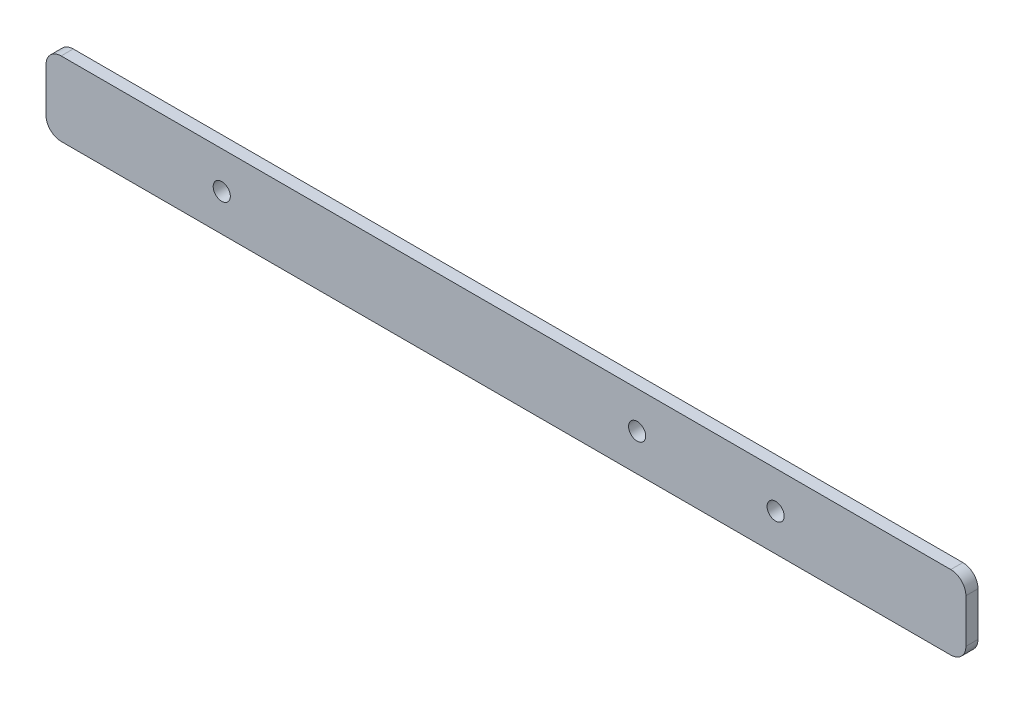
ISO-10303-21;
HEADER;
FILE_DESCRIPTION(('STEP AP214'),'2;1');
FILE_NAME('part.step','',(''),(''),'','','');
FILE_SCHEMA(('AUTOMOTIVE_DESIGN { 1 0 10303 214 1 1 1 1 }'));
ENDSEC;
DATA;
#1=APPLICATION_CONTEXT('core data for automotive mechanical design processes');
#2=APPLICATION_PROTOCOL_DEFINITION('international standard','automotive_design',2000,#1);
#3=PRODUCT_CONTEXT('',#1,'mechanical');
#4=PRODUCT('Part','Part','',(#3));
#5=PRODUCT_RELATED_PRODUCT_CATEGORY('part','',(#4));
#6=PRODUCT_DEFINITION_FORMATION('','',#4);
#7=PRODUCT_DEFINITION_CONTEXT('part definition',#1,'design');
#8=PRODUCT_DEFINITION('design','',#6,#7);
#9=PRODUCT_DEFINITION_SHAPE('','',#8);
#10=(LENGTH_UNIT() NAMED_UNIT(*) SI_UNIT(.MILLI.,.METRE.));
#11=(NAMED_UNIT(*) PLANE_ANGLE_UNIT() SI_UNIT($,.RADIAN.));
#12=(NAMED_UNIT(*) SI_UNIT($,.STERADIAN.) SOLID_ANGLE_UNIT());
#13=UNCERTAINTY_MEASURE_WITH_UNIT(LENGTH_MEASURE(1.E-05),#10,'distance_accuracy_value','');
#14=(GEOMETRIC_REPRESENTATION_CONTEXT(3) GLOBAL_UNCERTAINTY_ASSIGNED_CONTEXT((#13)) GLOBAL_UNIT_ASSIGNED_CONTEXT((#10,
#11,#12)) REPRESENTATION_CONTEXT('',''));
#15=CARTESIAN_POINT('',(0.,0.,0.));
#16=DIRECTION('',(0.,0.,1.));
#17=DIRECTION('',(1.,0.,0.));
#18=AXIS2_PLACEMENT_3D('',#15,#16,#17);
#19=CARTESIAN_POINT('',(0.,0.,3.175));
#20=DIRECTION('',(1.,0.,0.));
#21=DIRECTION('',(0.,0.,-1.));
#22=AXIS2_PLACEMENT_3D('',#19,#20,#21);
#23=PLANE('',#22);
#24=DIRECTION('',(0.,-1.,0.));
#25=VECTOR('',#24,1.);
#26=CARTESIAN_POINT('',(0.,0.,3.175));
#27=LINE('',#26,#25);
#28=CARTESIAN_POINT('',(0.,15.46225,3.175));
#29=VERTEX_POINT('',#28);
#30=CARTESIAN_POINT('',(0.,3.96875,3.175));
#31=VERTEX_POINT('',#30);
#32=EDGE_CURVE('E118',#29,#31,#27,.T.);
#33=ORIENTED_EDGE('',*,*,#32,.F.);
#34=DIRECTION('',(0.,0.,-1.));
#35=VECTOR('',#34,1.);
#36=CARTESIAN_POINT('',(0.,15.46225,3.175));
#37=LINE('',#36,#35);
#38=CARTESIAN_POINT('',(0.,15.46225,0.));
#39=VERTEX_POINT('',#38);
#40=EDGE_CURVE('E103',#29,#39,#37,.T.);
#41=ORIENTED_EDGE('',*,*,#40,.T.);
#42=DIRECTION('',(0.,-1.,0.));
#43=VECTOR('',#42,1.);
#44=CARTESIAN_POINT('',(0.,0.,0.));
#45=LINE('',#44,#43);
#46=CARTESIAN_POINT('',(0.,3.96875,0.));
#47=VERTEX_POINT('',#46);
#48=EDGE_CURVE('E115',#39,#47,#45,.T.);
#49=ORIENTED_EDGE('',*,*,#48,.T.);
#50=DIRECTION('',(0.,0.,-1.));
#51=VECTOR('',#50,1.);
#52=CARTESIAN_POINT('',(0.,3.96875,3.175));
#53=LINE('',#52,#51);
#54=EDGE_CURVE('E120',#47,#31,#53,.F.);
#55=ORIENTED_EDGE('',*,*,#54,.T.);
#56=EDGE_LOOP('',(#33,#41,#49,#55));
#57=FACE_BOUND('',#56,.T.);
#58=ADVANCED_FACE('F33',(#57),#23,.F.);
#59=CARTESIAN_POINT('',(0.,0.,3.175));
#60=DIRECTION('',(0.,1.,0.));
#61=DIRECTION('',(0.,0.,1.));
#62=AXIS2_PLACEMENT_3D('',#59,#60,#61);
#63=PLANE('',#62);
#64=DIRECTION('',(1.,0.,0.));
#65=VECTOR('',#64,1.);
#66=CARTESIAN_POINT('',(0.,0.,3.175));
#67=LINE('',#66,#65);
#68=CARTESIAN_POINT('',(3.96875,0.,3.175));
#69=VERTEX_POINT('',#68);
#70=CARTESIAN_POINT('',(237.33125,0.,3.175));
#71=VERTEX_POINT('',#70);
#72=EDGE_CURVE('E164',#69,#71,#67,.T.);
#73=ORIENTED_EDGE('',*,*,#72,.F.);
#74=DIRECTION('',(0.,0.,-1.));
#75=VECTOR('',#74,1.);
#76=CARTESIAN_POINT('',(3.96875,0.,3.175));
#77=LINE('',#76,#75);
#78=CARTESIAN_POINT('',(3.96875,0.,0.));
#79=VERTEX_POINT('',#78);
#80=EDGE_CURVE('E157',#69,#79,#77,.T.);
#81=ORIENTED_EDGE('',*,*,#80,.T.);
#82=DIRECTION('',(1.,0.,0.));
#83=VECTOR('',#82,1.);
#84=CARTESIAN_POINT('',(0.,0.,0.));
#85=LINE('',#84,#83);
#86=CARTESIAN_POINT('',(237.33125,0.,0.));
#87=VERTEX_POINT('',#86);
#88=EDGE_CURVE('E124',#79,#87,#85,.T.);
#89=ORIENTED_EDGE('',*,*,#88,.T.);
#90=DIRECTION('',(0.,0.,-1.));
#91=VECTOR('',#90,1.);
#92=CARTESIAN_POINT('',(237.33125,0.,3.175));
#93=LINE('',#92,#91);
#94=EDGE_CURVE('E155',#87,#71,#93,.F.);
#95=ORIENTED_EDGE('',*,*,#94,.T.);
#96=EDGE_LOOP('',(#73,#81,#89,#95));
#97=FACE_BOUND('',#96,.T.);
#98=ADVANCED_FACE('F162',(#97),#63,.F.);
#99=CARTESIAN_POINT('',(241.3,0.,3.175));
#100=DIRECTION('',(-1.,0.,0.));
#101=DIRECTION('',(0.,0.,1.));
#102=AXIS2_PLACEMENT_3D('',#99,#100,#101);
#103=PLANE('',#102);
#104=DIRECTION('',(0.,1.,0.));
#105=VECTOR('',#104,1.);
#106=CARTESIAN_POINT('',(241.3,0.,3.175));
#107=LINE('',#106,#105);
#108=CARTESIAN_POINT('',(241.3,3.96875,3.175));
#109=VERTEX_POINT('',#108);
#110=CARTESIAN_POINT('',(241.3,15.46225,3.175));
#111=VERTEX_POINT('',#110);
#112=EDGE_CURVE('E172',#109,#111,#107,.T.);
#113=ORIENTED_EDGE('',*,*,#112,.F.);
#114=DIRECTION('',(0.,0.,-1.));
#115=VECTOR('',#114,1.);
#116=CARTESIAN_POINT('',(241.3,3.96875,3.175));
#117=LINE('',#116,#115);
#118=CARTESIAN_POINT('',(241.3,3.96875,0.));
#119=VERTEX_POINT('',#118);
#120=EDGE_CURVE('E11',#109,#119,#117,.T.);
#121=ORIENTED_EDGE('',*,*,#120,.T.);
#122=DIRECTION('',(0.,1.,0.));
#123=VECTOR('',#122,1.);
#124=CARTESIAN_POINT('',(241.3,0.,0.));
#125=LINE('',#124,#123);
#126=CARTESIAN_POINT('',(241.3,15.46225,0.));
#127=VERTEX_POINT('',#126);
#128=EDGE_CURVE('E128',#119,#127,#125,.T.);
#129=ORIENTED_EDGE('',*,*,#128,.T.);
#130=DIRECTION('',(0.,0.,-1.));
#131=VECTOR('',#130,1.);
#132=CARTESIAN_POINT('',(241.3,15.46225,3.175));
#133=LINE('',#132,#131);
#134=EDGE_CURVE('E41',#127,#111,#133,.F.);
#135=ORIENTED_EDGE('',*,*,#134,.T.);
#136=EDGE_LOOP('',(#113,#121,#129,#135));
#137=FACE_BOUND('',#136,.T.);
#138=ADVANCED_FACE('F171',(#137),#103,.F.);
#139=CARTESIAN_POINT('',(0.,19.431,3.175));
#140=DIRECTION('',(0.,-1.,0.));
#141=DIRECTION('',(0.,0.,-1.));
#142=AXIS2_PLACEMENT_3D('',#139,#140,#141);
#143=PLANE('',#142);
#144=DIRECTION('',(-1.,0.,0.));
#145=VECTOR('',#144,1.);
#146=CARTESIAN_POINT('',(0.,19.431,0.));
#147=LINE('',#146,#145);
#148=CARTESIAN_POINT('',(237.33125,19.431,0.));
#149=VERTEX_POINT('',#148);
#150=CARTESIAN_POINT('',(3.96875,19.431,0.));
#151=VERTEX_POINT('',#150);
#152=EDGE_CURVE('E138',#149,#151,#147,.T.);
#153=ORIENTED_EDGE('',*,*,#152,.T.);
#154=DIRECTION('',(0.,0.,-1.));
#155=VECTOR('',#154,1.);
#156=CARTESIAN_POINT('',(3.96875,19.431,3.175));
#157=LINE('',#156,#155);
#158=CARTESIAN_POINT('',(3.96875,19.431,3.175));
#159=VERTEX_POINT('',#158);
#160=EDGE_CURVE('E104',#151,#159,#157,.F.);
#161=ORIENTED_EDGE('',*,*,#160,.T.);
#162=DIRECTION('',(-1.,0.,0.));
#163=VECTOR('',#162,1.);
#164=CARTESIAN_POINT('',(0.,19.431,3.175));
#165=LINE('',#164,#163);
#166=CARTESIAN_POINT('',(237.33125,19.431,3.175));
#167=VERTEX_POINT('',#166);
#168=EDGE_CURVE('E134',#167,#159,#165,.T.);
#169=ORIENTED_EDGE('',*,*,#168,.F.);
#170=DIRECTION('',(0.,0.,-1.));
#171=VECTOR('',#170,1.);
#172=CARTESIAN_POINT('',(237.33125,19.431,3.175));
#173=LINE('',#172,#171);
#174=EDGE_CURVE('E109',#167,#149,#173,.T.);
#175=ORIENTED_EDGE('',*,*,#174,.T.);
#176=EDGE_LOOP('',(#153,#161,#169,#175));
#177=FACE_BOUND('',#176,.T.);
#178=ADVANCED_FACE('F198',(#177),#143,.F.);
#179=CARTESIAN_POINT('',(0.,0.,3.175));
#180=DIRECTION('',(0.,0.,-1.));
#181=DIRECTION('',(-1.,0.,0.));
#182=AXIS2_PLACEMENT_3D('',#179,#180,#181);
#183=PLANE('',#182);
#184=CARTESIAN_POINT('',(46.101,9.7155,3.175));
#185=DIRECTION('',(0.,0.,1.));
#186=DIRECTION('',(1.,0.,0.));
#187=AXIS2_PLACEMENT_3D('',#184,#185,#186);
#188=CIRCLE('',#187,2.24789999999999);
#189=CARTESIAN_POINT('',(48.3489,9.7155,3.175));
#190=VERTEX_POINT('',#189);
#191=EDGE_CURVE('E189',#190,#190,#188,.T.);
#192=ORIENTED_EDGE('',*,*,#191,.F.);
#193=EDGE_LOOP('',(#192));
#194=FACE_BOUND('',#193,.T.);
#195=CARTESIAN_POINT('',(155.067,9.7155,3.175));
#196=DIRECTION('',(0.,0.,1.));
#197=DIRECTION('',(1.,0.,0.));
#198=AXIS2_PLACEMENT_3D('',#195,#196,#197);
#199=CIRCLE('',#198,2.2479);
#200=CARTESIAN_POINT('',(157.3149,9.7155,3.175));
#201=VERTEX_POINT('',#200);
#202=EDGE_CURVE('E183',#201,#201,#199,.T.);
#203=ORIENTED_EDGE('',*,*,#202,.F.);
#204=EDGE_LOOP('',(#203));
#205=FACE_BOUND('',#204,.T.);
#206=CARTESIAN_POINT('',(191.389,9.7155,3.175));
#207=DIRECTION('',(0.,0.,1.));
#208=DIRECTION('',(1.,0.,0.));
#209=AXIS2_PLACEMENT_3D('',#206,#207,#208);
#210=CIRCLE('',#209,2.2479);
#211=CARTESIAN_POINT('',(193.6369,9.7155,3.175));
#212=VERTEX_POINT('',#211);
#213=EDGE_CURVE('E131',#212,#212,#210,.T.);
#214=ORIENTED_EDGE('',*,*,#213,.F.);
#215=EDGE_LOOP('',(#214));
#216=FACE_BOUND('',#215,.T.);
#217=ORIENTED_EDGE('',*,*,#168,.T.);
#218=CARTESIAN_POINT('',(3.96875,15.46225,3.175));
#219=DIRECTION('',(0.,0.,-1.));
#220=DIRECTION('',(-1.,0.,0.));
#221=AXIS2_PLACEMENT_3D('',#218,#219,#220);
#222=CIRCLE('',#221,3.96875);
#223=EDGE_CURVE('E153',#159,#29,#222,.F.);
#224=ORIENTED_EDGE('',*,*,#223,.T.);
#225=ORIENTED_EDGE('',*,*,#32,.T.);
#226=CARTESIAN_POINT('',(3.96875,3.96875,3.175));
#227=DIRECTION('',(0.,0.,-1.));
#228=DIRECTION('',(-1.,0.,0.));
#229=AXIS2_PLACEMENT_3D('',#226,#227,#228);
#230=CIRCLE('',#229,3.96875);
#231=EDGE_CURVE('E151',#31,#69,#230,.F.);
#232=ORIENTED_EDGE('',*,*,#231,.T.);
#233=ORIENTED_EDGE('',*,*,#72,.T.);
#234=CARTESIAN_POINT('',(237.33125,3.96875,3.175));
#235=DIRECTION('',(0.,0.,-1.));
#236=DIRECTION('',(-1.,0.,0.));
#237=AXIS2_PLACEMENT_3D('',#234,#235,#236);
#238=CIRCLE('',#237,3.96875);
#239=EDGE_CURVE('E54',#71,#109,#238,.F.);
#240=ORIENTED_EDGE('',*,*,#239,.T.);
#241=ORIENTED_EDGE('',*,*,#112,.T.);
#242=CARTESIAN_POINT('',(237.33125,15.46225,3.175));
#243=DIRECTION('',(0.,0.,-1.));
#244=DIRECTION('',(-1.,0.,0.));
#245=AXIS2_PLACEMENT_3D('',#242,#243,#244);
#246=CIRCLE('',#245,3.96875);
#247=EDGE_CURVE('E148',#111,#167,#246,.F.);
#248=ORIENTED_EDGE('',*,*,#247,.T.);
#249=EDGE_LOOP('',(#217,#224,#225,#232,#233,#240,#241,#248));
#250=FACE_BOUND('',#249,.T.);
#251=ADVANCED_FACE('F195',(#194,#205,#216,#250),#183,.F.);
#252=CARTESIAN_POINT('',(0.,0.,0.));
#253=DIRECTION('',(0.,0.,-1.));
#254=DIRECTION('',(-1.,0.,0.));
#255=AXIS2_PLACEMENT_3D('',#252,#253,#254);
#256=PLANE('',#255);
#257=CARTESIAN_POINT('',(46.101,9.7155,0.));
#258=DIRECTION('',(0.,0.,1.));
#259=DIRECTION('',(1.,0.,0.));
#260=AXIS2_PLACEMENT_3D('',#257,#258,#259);
#261=CIRCLE('',#260,2.2479);
#262=CARTESIAN_POINT('',(48.3489,9.7155,0.));
#263=VERTEX_POINT('',#262);
#264=EDGE_CURVE('E186',#263,#263,#261,.T.);
#265=ORIENTED_EDGE('',*,*,#264,.T.);
#266=EDGE_LOOP('',(#265));
#267=FACE_BOUND('',#266,.T.);
#268=CARTESIAN_POINT('',(155.067,9.7155,0.));
#269=DIRECTION('',(0.,0.,1.));
#270=DIRECTION('',(1.,0.,0.));
#271=AXIS2_PLACEMENT_3D('',#268,#269,#270);
#272=CIRCLE('',#271,2.2479);
#273=CARTESIAN_POINT('',(157.3149,9.7155,0.));
#274=VERTEX_POINT('',#273);
#275=EDGE_CURVE('E180',#274,#274,#272,.T.);
#276=ORIENTED_EDGE('',*,*,#275,.T.);
#277=EDGE_LOOP('',(#276));
#278=FACE_BOUND('',#277,.T.);
#279=CARTESIAN_POINT('',(191.389,9.7155,0.));
#280=DIRECTION('',(0.,0.,1.));
#281=DIRECTION('',(1.,0.,0.));
#282=AXIS2_PLACEMENT_3D('',#279,#280,#281);
#283=CIRCLE('',#282,2.2479);
#284=CARTESIAN_POINT('',(193.6369,9.7155,0.));
#285=VERTEX_POINT('',#284);
#286=EDGE_CURVE('E125',#285,#285,#283,.T.);
#287=ORIENTED_EDGE('',*,*,#286,.T.);
#288=EDGE_LOOP('',(#287));
#289=FACE_BOUND('',#288,.T.);
#290=ORIENTED_EDGE('',*,*,#48,.F.);
#291=CARTESIAN_POINT('',(3.96875,15.46225,0.));
#292=DIRECTION('',(0.,0.,-1.));
#293=DIRECTION('',(-1.,0.,0.));
#294=AXIS2_PLACEMENT_3D('',#291,#292,#293);
#295=CIRCLE('',#294,3.96875);
#296=EDGE_CURVE('E99',#39,#151,#295,.T.);
#297=ORIENTED_EDGE('',*,*,#296,.T.);
#298=ORIENTED_EDGE('',*,*,#152,.F.);
#299=CARTESIAN_POINT('',(237.33125,15.46225,0.));
#300=DIRECTION('',(0.,0.,-1.));
#301=DIRECTION('',(-1.,0.,0.));
#302=AXIS2_PLACEMENT_3D('',#299,#300,#301);
#303=CIRCLE('',#302,3.96875);
#304=EDGE_CURVE('E119',#149,#127,#303,.T.);
#305=ORIENTED_EDGE('',*,*,#304,.T.);
#306=ORIENTED_EDGE('',*,*,#128,.F.);
#307=CARTESIAN_POINT('',(237.33125,3.96875,0.));
#308=DIRECTION('',(0.,0.,-1.));
#309=DIRECTION('',(-1.,0.,0.));
#310=AXIS2_PLACEMENT_3D('',#307,#308,#309);
#311=CIRCLE('',#310,3.96875);
#312=EDGE_CURVE('E142',#119,#87,#311,.T.);
#313=ORIENTED_EDGE('',*,*,#312,.T.);
#314=ORIENTED_EDGE('',*,*,#88,.F.);
#315=CARTESIAN_POINT('',(3.96875,3.96875,0.));
#316=DIRECTION('',(0.,0.,-1.));
#317=DIRECTION('',(-1.,0.,0.));
#318=AXIS2_PLACEMENT_3D('',#315,#316,#317);
#319=CIRCLE('',#318,3.96875);
#320=EDGE_CURVE('E110',#79,#47,#319,.T.);
#321=ORIENTED_EDGE('',*,*,#320,.T.);
#322=EDGE_LOOP('',(#290,#297,#298,#305,#306,#313,#314,#321));
#323=FACE_BOUND('',#322,.T.);
#324=ADVANCED_FACE('F122',(#267,#278,#289,#323),#256,.T.);
#325=CARTESIAN_POINT('',(191.389,9.7155,3.175));
#326=DIRECTION('',(0.,0.,1.));
#327=DIRECTION('',(1.,0.,0.));
#328=AXIS2_PLACEMENT_3D('',#325,#326,#327);
#329=CYLINDRICAL_SURFACE('',#328,2.2479);
#330=ORIENTED_EDGE('',*,*,#286,.F.);
#331=EDGE_LOOP('',(#330));
#332=FACE_BOUND('',#331,.T.);
#333=ORIENTED_EDGE('',*,*,#213,.T.);
#334=EDGE_LOOP('',(#333));
#335=FACE_BOUND('',#334,.T.);
#336=ADVANCED_FACE('F261',(#332,#335),#329,.F.);
#337=CARTESIAN_POINT('',(155.067,9.7155,3.175));
#338=DIRECTION('',(0.,0.,1.));
#339=DIRECTION('',(1.,0.,0.));
#340=AXIS2_PLACEMENT_3D('',#337,#338,#339);
#341=CYLINDRICAL_SURFACE('',#340,2.2479);
#342=ORIENTED_EDGE('',*,*,#275,.F.);
#343=EDGE_LOOP('',(#342));
#344=FACE_BOUND('',#343,.T.);
#345=ORIENTED_EDGE('',*,*,#202,.T.);
#346=EDGE_LOOP('',(#345));
#347=FACE_BOUND('',#346,.T.);
#348=ADVANCED_FACE('F252',(#344,#347),#341,.F.);
#349=CARTESIAN_POINT('',(46.101,9.7155,3.175));
#350=DIRECTION('',(0.,0.,1.));
#351=DIRECTION('',(1.,0.,0.));
#352=AXIS2_PLACEMENT_3D('',#349,#350,#351);
#353=CYLINDRICAL_SURFACE('',#352,2.24789999999999);
#354=ORIENTED_EDGE('',*,*,#264,.F.);
#355=EDGE_LOOP('',(#354));
#356=FACE_BOUND('',#355,.T.);
#357=ORIENTED_EDGE('',*,*,#191,.T.);
#358=EDGE_LOOP('',(#357));
#359=FACE_BOUND('',#358,.T.);
#360=ADVANCED_FACE('F193',(#356,#359),#353,.F.);
#361=CARTESIAN_POINT('',(3.96875,15.46225,3.175));
#362=DIRECTION('',(0.,0.,-1.));
#363=DIRECTION('',(-1.,0.,0.));
#364=AXIS2_PLACEMENT_3D('',#361,#362,#363);
#365=CYLINDRICAL_SURFACE('',#364,3.96875);
#366=ORIENTED_EDGE('',*,*,#223,.F.);
#367=ORIENTED_EDGE('',*,*,#160,.F.);
#368=ORIENTED_EDGE('',*,*,#296,.F.);
#369=ORIENTED_EDGE('',*,*,#40,.F.);
#370=EDGE_LOOP('',(#366,#367,#368,#369));
#371=FACE_BOUND('',#370,.T.);
#372=ADVANCED_FACE('F102',(#371),#365,.T.);
#373=CARTESIAN_POINT('',(3.96875,3.96875,3.175));
#374=DIRECTION('',(0.,0.,-1.));
#375=DIRECTION('',(-1.,0.,0.));
#376=AXIS2_PLACEMENT_3D('',#373,#374,#375);
#377=CYLINDRICAL_SURFACE('',#376,3.96875);
#378=ORIENTED_EDGE('',*,*,#231,.F.);
#379=ORIENTED_EDGE('',*,*,#54,.F.);
#380=ORIENTED_EDGE('',*,*,#320,.F.);
#381=ORIENTED_EDGE('',*,*,#80,.F.);
#382=EDGE_LOOP('',(#378,#379,#380,#381));
#383=FACE_BOUND('',#382,.T.);
#384=ADVANCED_FACE('F211',(#383),#377,.T.);
#385=CARTESIAN_POINT('',(237.33125,3.96875,3.175));
#386=DIRECTION('',(0.,0.,-1.));
#387=DIRECTION('',(-1.,0.,0.));
#388=AXIS2_PLACEMENT_3D('',#385,#386,#387);
#389=CYLINDRICAL_SURFACE('',#388,3.96875);
#390=ORIENTED_EDGE('',*,*,#239,.F.);
#391=ORIENTED_EDGE('',*,*,#94,.F.);
#392=ORIENTED_EDGE('',*,*,#312,.F.);
#393=ORIENTED_EDGE('',*,*,#120,.F.);
#394=EDGE_LOOP('',(#390,#391,#392,#393));
#395=FACE_BOUND('',#394,.T.);
#396=ADVANCED_FACE('F170',(#395),#389,.T.);
#397=CARTESIAN_POINT('',(237.33125,15.46225,3.175));
#398=DIRECTION('',(0.,0.,-1.));
#399=DIRECTION('',(-1.,0.,0.));
#400=AXIS2_PLACEMENT_3D('',#397,#398,#399);
#401=CYLINDRICAL_SURFACE('',#400,3.96875);
#402=ORIENTED_EDGE('',*,*,#247,.F.);
#403=ORIENTED_EDGE('',*,*,#134,.F.);
#404=ORIENTED_EDGE('',*,*,#304,.F.);
#405=ORIENTED_EDGE('',*,*,#174,.F.);
#406=EDGE_LOOP('',(#402,#403,#404,#405));
#407=FACE_BOUND('',#406,.T.);
#408=ADVANCED_FACE('F35',(#407),#401,.T.);
#409=CLOSED_SHELL('',(#58,#98,#138,#178,#251,#324,#336,#348,#360,#372,#384,#396,#408));
#410=MANIFOLD_SOLID_BREP('B2',#409);
#411=ADVANCED_BREP_SHAPE_REPRESENTATION('',(#18,#410),#14);
#412=SHAPE_DEFINITION_REPRESENTATION(#9,#411);
ENDSEC;
END-ISO-10303-21;
